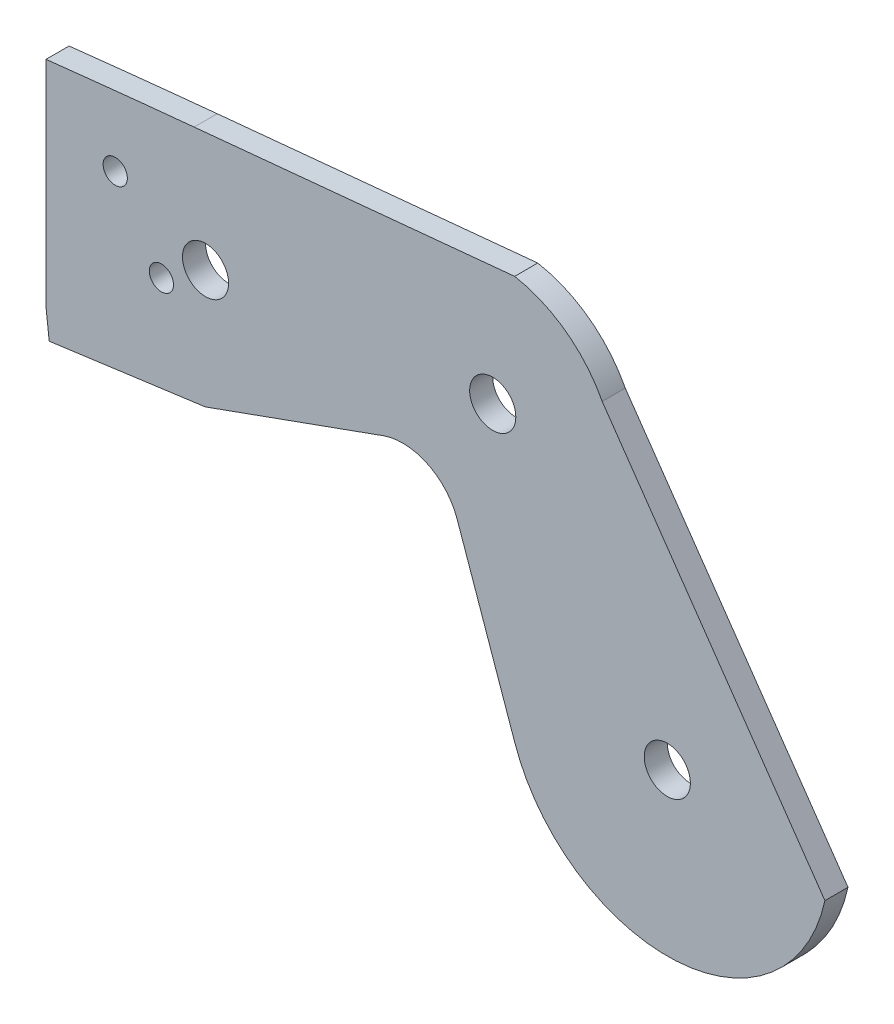
ISO-10303-21;
HEADER;
FILE_DESCRIPTION(('STEP AP214'),'2;1');
FILE_NAME('part.step','',(''),(''),'','','');
FILE_SCHEMA(('AUTOMOTIVE_DESIGN { 1 0 10303 214 1 1 1 1 }'));
ENDSEC;
DATA;
#1=APPLICATION_CONTEXT('core data for automotive mechanical design processes');
#2=APPLICATION_PROTOCOL_DEFINITION('international standard','automotive_design',2000,#1);
#3=PRODUCT_CONTEXT('',#1,'mechanical');
#4=PRODUCT('Part','Part','',(#3));
#5=PRODUCT_RELATED_PRODUCT_CATEGORY('part','',(#4));
#6=PRODUCT_DEFINITION_FORMATION('','',#4);
#7=PRODUCT_DEFINITION_CONTEXT('part definition',#1,'design');
#8=PRODUCT_DEFINITION('design','',#6,#7);
#9=PRODUCT_DEFINITION_SHAPE('','',#8);
#10=(LENGTH_UNIT() NAMED_UNIT(*) SI_UNIT(.MILLI.,.METRE.));
#11=(NAMED_UNIT(*) PLANE_ANGLE_UNIT() SI_UNIT($,.RADIAN.));
#12=(NAMED_UNIT(*) SI_UNIT($,.STERADIAN.) SOLID_ANGLE_UNIT());
#13=UNCERTAINTY_MEASURE_WITH_UNIT(LENGTH_MEASURE(1.E-05),#10,'distance_accuracy_value','');
#14=(GEOMETRIC_REPRESENTATION_CONTEXT(3) GLOBAL_UNCERTAINTY_ASSIGNED_CONTEXT((#13)) GLOBAL_UNIT_ASSIGNED_CONTEXT((#10,
#11,#12)) REPRESENTATION_CONTEXT('',''));
#15=CARTESIAN_POINT('',(0.,0.,0.));
#16=DIRECTION('',(0.,0.,1.));
#17=DIRECTION('',(1.,0.,0.));
#18=AXIS2_PLACEMENT_3D('',#15,#16,#17);
#19=CARTESIAN_POINT('',(78.8817099723591,27.6055271060531,4.));
#20=DIRECTION('',(0.943869814927785,0.330317684159035,0.));
#21=DIRECTION('',(-0.330317684159035,0.943869814927785,0.));
#22=AXIS2_PLACEMENT_3D('',#19,#20,#21);
#23=PLANE('',#22);
#24=DIRECTION('',(0.330317684159035,-0.943869814927785,0.));
#25=VECTOR('',#24,1.);
#26=CARTESIAN_POINT('',(78.8817099723591,27.6055271060531,0.));
#27=LINE('',#26,#25);
#28=CARTESIAN_POINT('',(71.2477694864193,49.4192123526611,0.));
#29=VERTEX_POINT('',#28);
#30=CARTESIAN_POINT('',(81.1757562039249,21.0503800586389,0.));
#31=VERTEX_POINT('',#30);
#32=EDGE_CURVE('E182',#29,#31,#27,.T.);
#33=ORIENTED_EDGE('',*,*,#32,.T.);
#34=DIRECTION('',(0.,0.,-1.));
#35=VECTOR('',#34,1.);
#36=CARTESIAN_POINT('',(81.1757562039249,21.0503800586389,4.));
#37=LINE('',#36,#35);
#38=CARTESIAN_POINT('',(81.1757562039249,21.0503800586389,4.));
#39=VERTEX_POINT('',#38);
#40=EDGE_CURVE('E11',#39,#31,#37,.T.);
#41=ORIENTED_EDGE('',*,*,#40,.F.);
#42=DIRECTION('',(0.330317684159035,-0.943869814927785,0.));
#43=VECTOR('',#42,1.);
#44=CARTESIAN_POINT('',(78.8817099723591,27.6055271060531,4.));
#45=LINE('',#44,#43);
#46=CARTESIAN_POINT('',(71.2477694864193,49.4192123526611,4.));
#47=VERTEX_POINT('',#46);
#48=EDGE_CURVE('E268',#47,#39,#45,.T.);
#49=ORIENTED_EDGE('',*,*,#48,.F.);
#50=DIRECTION('',(0.,0.,-1.));
#51=VECTOR('',#50,1.);
#52=CARTESIAN_POINT('',(71.2477694864193,49.4192123526611,4.));
#53=LINE('',#52,#51);
#54=EDGE_CURVE('E158',#47,#29,#53,.T.);
#55=ORIENTED_EDGE('',*,*,#54,.T.);
#56=EDGE_LOOP('',(#33,#41,#49,#55));
#57=FACE_BOUND('',#56,.T.);
#58=ADVANCED_FACE('F41',(#57),#23,.F.);
#59=CARTESIAN_POINT('',(107.662812973354,30.,4.));
#60=DIRECTION('',(0.,0.,-1.));
#61=DIRECTION('',(-1.,0.,0.));
#62=AXIS2_PLACEMENT_3D('',#59,#60,#61);
#63=CYLINDRICAL_SURFACE('',#62,27.9581807956413);
#64=CARTESIAN_POINT('',(107.662812973354,30.,0.));
#65=DIRECTION('',(0.,0.,1.));
#66=DIRECTION('',(1.,0.,0.));
#67=AXIS2_PLACEMENT_3D('',#64,#65,#66);
#68=CIRCLE('',#67,27.9581807956413);
#69=CARTESIAN_POINT('',(134.977054883392,24.0340916633161,0.));
#70=VERTEX_POINT('',#69);
#71=EDGE_CURVE('E186',#31,#70,#68,.T.);
#72=ORIENTED_EDGE('',*,*,#71,.T.);
#73=DIRECTION('',(0.,0.,-1.));
#74=VECTOR('',#73,1.);
#75=CARTESIAN_POINT('',(134.977054883392,24.0340916633161,4.));
#76=LINE('',#75,#74);
#77=CARTESIAN_POINT('',(134.977054883392,24.0340916633161,4.));
#78=VERTEX_POINT('',#77);
#79=EDGE_CURVE('E51',#78,#70,#76,.T.);
#80=ORIENTED_EDGE('',*,*,#79,.F.);
#81=CARTESIAN_POINT('',(107.662812973354,30.,4.));
#82=DIRECTION('',(0.,0.,1.));
#83=DIRECTION('',(1.,0.,0.));
#84=AXIS2_PLACEMENT_3D('',#81,#82,#83);
#85=CIRCLE('',#84,27.9581807956413);
#86=EDGE_CURVE('E111',#39,#78,#85,.T.);
#87=ORIENTED_EDGE('',*,*,#86,.F.);
#88=ORIENTED_EDGE('',*,*,#40,.T.);
#89=EDGE_LOOP('',(#72,#80,#87,#88));
#90=FACE_BOUND('',#89,.T.);
#91=ADVANCED_FACE('F247',(#90),#63,.T.);
#92=CARTESIAN_POINT('',(102.357579070315,71.036194972334,4.));
#93=DIRECTION('',(0.821540862063693,0.570149639971511,0.));
#94=DIRECTION('',(-0.570149639971511,0.821540862063693,0.));
#95=AXIS2_PLACEMENT_3D('',#92,#93,#94);
#96=PLANE('',#95);
#97=DIRECTION('',(0.570149639971511,-0.821540862063693,0.));
#98=VECTOR('',#97,1.);
#99=CARTESIAN_POINT('',(102.357579070315,71.036194972334,0.));
#100=LINE('',#99,#98);
#101=CARTESIAN_POINT('',(96.3802559625134,79.6490482209344,0.));
#102=VERTEX_POINT('',#101);
#103=EDGE_CURVE('E190',#102,#70,#100,.T.);
#104=ORIENTED_EDGE('',*,*,#103,.F.);
#105=DIRECTION('',(0.,0.,-1.));
#106=VECTOR('',#105,1.);
#107=CARTESIAN_POINT('',(96.3802559625134,79.6490482209344,4.));
#108=LINE('',#107,#106);
#109=CARTESIAN_POINT('',(96.3802559625134,79.6490482209344,4.));
#110=VERTEX_POINT('',#109);
#111=EDGE_CURVE('E238',#110,#102,#108,.T.);
#112=ORIENTED_EDGE('',*,*,#111,.F.);
#113=DIRECTION('',(0.570149639971511,-0.821540862063693,0.));
#114=VECTOR('',#113,1.);
#115=CARTESIAN_POINT('',(102.357579070315,71.036194972334,4.));
#116=LINE('',#115,#114);
#117=EDGE_CURVE('E246',#110,#78,#116,.T.);
#118=ORIENTED_EDGE('',*,*,#117,.T.);
#119=ORIENTED_EDGE('',*,*,#79,.T.);
#120=EDGE_LOOP('',(#104,#112,#118,#119));
#121=FACE_BOUND('',#120,.T.);
#122=ADVANCED_FACE('F244',(#121),#96,.T.);
#123=CARTESIAN_POINT('',(77.4123392683536,69.8109135868933,4.));
#124=DIRECTION('',(0.,0.,-1.));
#125=DIRECTION('',(-1.,0.,0.));
#126=AXIS2_PLACEMENT_3D('',#123,#124,#125);
#127=CYLINDRICAL_SURFACE('',#126,21.3675163927421);
#128=CARTESIAN_POINT('',(77.4123392683536,69.8109135868933,0.));
#129=DIRECTION('',(0.,0.,1.));
#130=DIRECTION('',(1.,0.,0.));
#131=AXIS2_PLACEMENT_3D('',#128,#129,#130);
#132=CIRCLE('',#131,21.3675163927421);
#133=CARTESIAN_POINT('',(81.2137044633508,90.8375723668414,0.));
#134=VERTEX_POINT('',#133);
#135=EDGE_CURVE('E194',#102,#134,#132,.T.);
#136=ORIENTED_EDGE('',*,*,#135,.T.);
#137=DIRECTION('',(0.,0.,-1.));
#138=VECTOR('',#137,1.);
#139=CARTESIAN_POINT('',(81.2137044633508,90.8375723668414,4.));
#140=LINE('',#139,#138);
#141=CARTESIAN_POINT('',(81.2137044633508,90.8375723668414,4.));
#142=VERTEX_POINT('',#141);
#143=EDGE_CURVE('E235',#142,#134,#140,.T.);
#144=ORIENTED_EDGE('',*,*,#143,.F.);
#145=CARTESIAN_POINT('',(77.4123392683536,69.8109135868933,4.));
#146=DIRECTION('',(0.,0.,1.));
#147=DIRECTION('',(1.,0.,0.));
#148=AXIS2_PLACEMENT_3D('',#145,#146,#147);
#149=CIRCLE('',#148,21.3675163927421);
#150=EDGE_CURVE('E260',#110,#142,#149,.T.);
#151=ORIENTED_EDGE('',*,*,#150,.F.);
#152=ORIENTED_EDGE('',*,*,#111,.T.);
#153=EDGE_LOOP('',(#136,#144,#151,#152));
#154=FACE_BOUND('',#153,.T.);
#155=ADVANCED_FACE('F257',(#154),#127,.T.);
#156=CARTESIAN_POINT('',(-7.94780890689138,82.2186159148116,4.));
#157=DIRECTION('',(-0.0962182717378652,0.995360258491255,0.));
#158=DIRECTION('',(-0.995360258491255,-0.0962182717378652,0.));
#159=AXIS2_PLACEMENT_3D('',#156,#157,#158);
#160=PLANE('',#159);
#161=DIRECTION('',(0.995360258491255,0.0962182717378652,0.));
#162=VECTOR('',#161,1.);
#163=CARTESIAN_POINT('',(-7.94780890689138,82.2186159148116,0.));
#164=LINE('',#163,#162);
#165=CARTESIAN_POINT('',(25.6657573338973,85.4679311482099,0.));
#166=VERTEX_POINT('',#165);
#167=EDGE_CURVE('E198',#166,#134,#164,.T.);
#168=ORIENTED_EDGE('',*,*,#167,.F.);
#169=DIRECTION('',(0.,0.,-1.));
#170=VECTOR('',#169,1.);
#171=CARTESIAN_POINT('',(25.6657573338973,85.4679311482099,4.));
#172=LINE('',#171,#170);
#173=CARTESIAN_POINT('',(25.6657573338973,85.4679311482099,4.));
#174=VERTEX_POINT('',#173);
#175=EDGE_CURVE('E232',#174,#166,#172,.T.);
#176=ORIENTED_EDGE('',*,*,#175,.F.);
#177=DIRECTION('',(0.995360258491255,0.0962182717378652,0.));
#178=VECTOR('',#177,1.);
#179=CARTESIAN_POINT('',(-7.94780890689138,82.2186159148116,4.));
#180=LINE('',#179,#178);
#181=EDGE_CURVE('E263',#174,#142,#180,.T.);
#182=ORIENTED_EDGE('',*,*,#181,.T.);
#183=ORIENTED_EDGE('',*,*,#143,.T.);
#184=EDGE_LOOP('',(#168,#176,#182,#183));
#185=FACE_BOUND('',#184,.T.);
#186=ADVANCED_FACE('F437',(#185),#160,.T.);
#187=CARTESIAN_POINT('',(197.220867112833,-1689.23800911509,4.));
#188=DIRECTION('',(0.,0.,-1.));
#189=DIRECTION('',(-1.,0.,0.));
#190=AXIS2_PLACEMENT_3D('',#187,#188,#189);
#191=CYLINDRICAL_SURFACE('',#190,1782.97849961717);
#192=CARTESIAN_POINT('',(197.220867112833,-1689.23800911509,0.));
#193=DIRECTION('',(0.,0.,1.));
#194=DIRECTION('',(1.,0.,0.));
#195=AXIS2_PLACEMENT_3D('',#192,#193,#194);
#196=CIRCLE('',#195,1782.97849961717);
#197=CARTESIAN_POINT('',(0.,82.7993098125808,0.));
#198=VERTEX_POINT('',#197);
#199=EDGE_CURVE('E202',#166,#198,#196,.T.);
#200=ORIENTED_EDGE('',*,*,#199,.T.);
#201=DIRECTION('',(0.,0.,-1.));
#202=VECTOR('',#201,1.);
#203=CARTESIAN_POINT('',(0.,82.7993098125808,4.));
#204=LINE('',#203,#202);
#205=CARTESIAN_POINT('',(0.,82.7993098125808,4.));
#206=VERTEX_POINT('',#205);
#207=EDGE_CURVE('E229',#206,#198,#204,.T.);
#208=ORIENTED_EDGE('',*,*,#207,.F.);
#209=CARTESIAN_POINT('',(197.220867112833,-1689.23800911509,4.));
#210=DIRECTION('',(0.,0.,1.));
#211=DIRECTION('',(1.,0.,0.));
#212=AXIS2_PLACEMENT_3D('',#209,#210,#211);
#213=CIRCLE('',#212,1782.97849961717);
#214=EDGE_CURVE('E274',#174,#206,#213,.T.);
#215=ORIENTED_EDGE('',*,*,#214,.F.);
#216=ORIENTED_EDGE('',*,*,#175,.T.);
#217=EDGE_LOOP('',(#200,#208,#215,#216));
#218=FACE_BOUND('',#217,.T.);
#219=ADVANCED_FACE('F287',(#218),#191,.T.);
#220=CARTESIAN_POINT('',(0.,0.,4.));
#221=DIRECTION('',(-1.,0.,0.));
#222=DIRECTION('',(0.,0.,1.));
#223=AXIS2_PLACEMENT_3D('',#220,#221,#222);
#224=PLANE('',#223);
#225=DIRECTION('',(0.,1.,0.));
#226=VECTOR('',#225,1.);
#227=CARTESIAN_POINT('',(0.,0.,0.));
#228=LINE('',#227,#226);
#229=CARTESIAN_POINT('',(0.,45.6506733001944,0.));
#230=VERTEX_POINT('',#229);
#231=EDGE_CURVE('E206',#230,#198,#228,.T.);
#232=ORIENTED_EDGE('',*,*,#231,.F.);
#233=DIRECTION('',(0.,0.,-1.));
#234=VECTOR('',#233,1.);
#235=CARTESIAN_POINT('',(0.,45.6506733001944,4.));
#236=LINE('',#235,#234);
#237=CARTESIAN_POINT('',(0.,45.6506733001944,4.));
#238=VERTEX_POINT('',#237);
#239=EDGE_CURVE('E226',#238,#230,#236,.T.);
#240=ORIENTED_EDGE('',*,*,#239,.F.);
#241=DIRECTION('',(0.,1.,0.));
#242=VECTOR('',#241,1.);
#243=CARTESIAN_POINT('',(0.,0.,4.));
#244=LINE('',#243,#242);
#245=EDGE_CURVE('E277',#238,#206,#244,.T.);
#246=ORIENTED_EDGE('',*,*,#245,.T.);
#247=ORIENTED_EDGE('',*,*,#207,.T.);
#248=EDGE_LOOP('',(#232,#240,#246,#247));
#249=FACE_BOUND('',#248,.T.);
#250=ADVANCED_FACE('F283',(#249),#224,.T.);
#251=CARTESIAN_POINT('',(5.12332628744823,0.582415957377632,4.));
#252=DIRECTION('',(0.993600471899069,0.112951769538807,0.));
#253=DIRECTION('',(-0.112951769538807,0.993600471899069,0.));
#254=AXIS2_PLACEMENT_3D('',#251,#252,#253);
#255=PLANE('',#254);
#256=DIRECTION('',(0.112951769538807,-0.993600471899069,0.));
#257=VECTOR('',#256,1.);
#258=CARTESIAN_POINT('',(5.12332628744823,0.582415957377632,0.));
#259=LINE('',#258,#257);
#260=CARTESIAN_POINT('',(0.554484915209473,40.7730474279962,0.));
#261=VERTEX_POINT('',#260);
#262=EDGE_CURVE('E210',#230,#261,#259,.T.);
#263=ORIENTED_EDGE('',*,*,#262,.T.);
#264=DIRECTION('',(0.,0.,-1.));
#265=VECTOR('',#264,1.);
#266=CARTESIAN_POINT('',(0.554484915209473,40.7730474279962,4.));
#267=LINE('',#266,#265);
#268=CARTESIAN_POINT('',(0.554484915209473,40.7730474279962,4.));
#269=VERTEX_POINT('',#268);
#270=EDGE_CURVE('E151',#269,#261,#267,.T.);
#271=ORIENTED_EDGE('',*,*,#270,.F.);
#272=DIRECTION('',(0.112951769538807,-0.993600471899069,0.));
#273=VECTOR('',#272,1.);
#274=CARTESIAN_POINT('',(5.12332628744823,0.582415957377632,4.));
#275=LINE('',#274,#273);
#276=EDGE_CURVE('E140',#238,#269,#275,.T.);
#277=ORIENTED_EDGE('',*,*,#276,.F.);
#278=ORIENTED_EDGE('',*,*,#239,.T.);
#279=EDGE_LOOP('',(#263,#271,#277,#278));
#280=FACE_BOUND('',#279,.T.);
#281=ADVANCED_FACE('F290',(#280),#255,.F.);
#282=CARTESIAN_POINT('',(-5.41460505653085,39.9643194121234,4.));
#283=DIRECTION('',(-0.134259323213009,0.990946231705023,0.));
#284=DIRECTION('',(-0.990946231705023,-0.134259323213009,0.));
#285=AXIS2_PLACEMENT_3D('',#282,#283,#284);
#286=PLANE('',#285);
#287=DIRECTION('',(0.990946231705023,0.134259323213009,0.));
#288=VECTOR('',#287,1.);
#289=CARTESIAN_POINT('',(-5.41460505653085,39.9643194121234,0.));
#290=LINE('',#289,#288);
#291=CARTESIAN_POINT('',(27.595444365701,44.4367183706737,0.));
#292=VERTEX_POINT('',#291);
#293=EDGE_CURVE('E149',#261,#292,#290,.T.);
#294=ORIENTED_EDGE('',*,*,#293,.T.);
#295=DIRECTION('',(0.,0.,-1.));
#296=VECTOR('',#295,1.);
#297=CARTESIAN_POINT('',(27.595444365701,44.4367183706737,4.));
#298=LINE('',#297,#296);
#299=CARTESIAN_POINT('',(27.595444365701,44.4367183706737,4.));
#300=VERTEX_POINT('',#299);
#301=EDGE_CURVE('E146',#300,#292,#298,.T.);
#302=ORIENTED_EDGE('',*,*,#301,.F.);
#303=DIRECTION('',(0.990946231705023,0.134259323213009,0.));
#304=VECTOR('',#303,1.);
#305=CARTESIAN_POINT('',(-5.41460505653085,39.9643194121234,4.));
#306=LINE('',#305,#304);
#307=EDGE_CURVE('E133',#269,#300,#306,.T.);
#308=ORIENTED_EDGE('',*,*,#307,.F.);
#309=ORIENTED_EDGE('',*,*,#270,.T.);
#310=EDGE_LOOP('',(#294,#302,#308,#309));
#311=FACE_BOUND('',#310,.T.);
#312=ADVANCED_FACE('F147',(#311),#286,.F.);
#313=CARTESIAN_POINT('',(-10.9913315622301,30.5571502696171,4.));
#314=DIRECTION('',(-0.338467495274097,0.940978084039623,0.));
#315=DIRECTION('',(-0.940978084039623,-0.338467495274097,0.));
#316=AXIS2_PLACEMENT_3D('',#313,#314,#315);
#317=PLANE('',#316);
#318=DIRECTION('',(0.940978084039623,0.338467495274097,0.));
#319=VECTOR('',#318,1.);
#320=CARTESIAN_POINT('',(-10.9913315622301,30.5571502696171,0.));
#321=LINE('',#320,#319);
#322=CARTESIAN_POINT('',(58.4243963844005,55.525816351467,0.));
#323=VERTEX_POINT('',#322);
#324=EDGE_CURVE('E97',#292,#323,#321,.T.);
#325=ORIENTED_EDGE('',*,*,#324,.T.);
#326=DIRECTION('',(0.,0.,-1.));
#327=VECTOR('',#326,1.);
#328=CARTESIAN_POINT('',(58.4243963844005,55.525816351467,4.));
#329=LINE('',#328,#327);
#330=CARTESIAN_POINT('',(58.4243963844005,55.525816351467,4.));
#331=VERTEX_POINT('',#330);
#332=EDGE_CURVE('E152',#331,#323,#329,.T.);
#333=ORIENTED_EDGE('',*,*,#332,.F.);
#334=DIRECTION('',(0.940978084039623,0.338467495274097,0.));
#335=VECTOR('',#334,1.);
#336=CARTESIAN_POINT('',(-10.9913315622301,30.5571502696171,4.));
#337=LINE('',#336,#335);
#338=EDGE_CURVE('E137',#300,#331,#337,.T.);
#339=ORIENTED_EDGE('',*,*,#338,.F.);
#340=ORIENTED_EDGE('',*,*,#301,.T.);
#341=EDGE_LOOP('',(#325,#333,#339,#340));
#342=FACE_BOUND('',#341,.T.);
#343=ADVANCED_FACE('F154',(#342),#317,.F.);
#344=CARTESIAN_POINT('',(20.,60.,4.));
#345=DIRECTION('',(0.,0.,-1.));
#346=DIRECTION('',(-1.,0.,0.));
#347=AXIS2_PLACEMENT_3D('',#344,#345,#346);
#348=CYLINDRICAL_SURFACE('',#347,2.1);
#349=CARTESIAN_POINT('',(20.,60.,4.));
#350=DIRECTION('',(0.,0.,1.));
#351=DIRECTION('',(1.,0.,0.));
#352=AXIS2_PLACEMENT_3D('',#349,#350,#351);
#353=CIRCLE('',#352,2.1);
#354=CARTESIAN_POINT('',(22.1,60.,4.));
#355=VERTEX_POINT('',#354);
#356=EDGE_CURVE('E491',#355,#355,#353,.T.);
#357=ORIENTED_EDGE('',*,*,#356,.T.);
#358=EDGE_LOOP('',(#357));
#359=FACE_BOUND('',#358,.T.);
#360=CARTESIAN_POINT('',(20.,60.,0.));
#361=DIRECTION('',(0.,0.,1.));
#362=DIRECTION('',(1.,0.,0.));
#363=AXIS2_PLACEMENT_3D('',#360,#361,#362);
#364=CIRCLE('',#363,2.1);
#365=CARTESIAN_POINT('',(22.1,60.,0.));
#366=VERTEX_POINT('',#365);
#367=EDGE_CURVE('E178',#366,#366,#364,.T.);
#368=ORIENTED_EDGE('',*,*,#367,.F.);
#369=EDGE_LOOP('',(#368));
#370=FACE_BOUND('',#369,.T.);
#371=ADVANCED_FACE('F308',(#359,#370),#348,.F.);
#372=CARTESIAN_POINT('',(12.,72.,4.));
#373=DIRECTION('',(0.,0.,-1.));
#374=DIRECTION('',(-1.,0.,0.));
#375=AXIS2_PLACEMENT_3D('',#372,#373,#374);
#376=CYLINDRICAL_SURFACE('',#375,2.1);
#377=CARTESIAN_POINT('',(12.,72.,4.));
#378=DIRECTION('',(0.,0.,1.));
#379=DIRECTION('',(1.,0.,0.));
#380=AXIS2_PLACEMENT_3D('',#377,#378,#379);
#381=CIRCLE('',#380,2.1);
#382=CARTESIAN_POINT('',(14.1,72.,4.));
#383=VERTEX_POINT('',#382);
#384=EDGE_CURVE('E488',#383,#383,#381,.T.);
#385=ORIENTED_EDGE('',*,*,#384,.T.);
#386=EDGE_LOOP('',(#385));
#387=FACE_BOUND('',#386,.T.);
#388=CARTESIAN_POINT('',(12.,72.,0.));
#389=DIRECTION('',(0.,0.,1.));
#390=DIRECTION('',(1.,0.,0.));
#391=AXIS2_PLACEMENT_3D('',#388,#389,#390);
#392=CIRCLE('',#391,2.1);
#393=CARTESIAN_POINT('',(14.1,72.,0.));
#394=VERTEX_POINT('',#393);
#395=EDGE_CURVE('E174',#394,#394,#392,.T.);
#396=ORIENTED_EDGE('',*,*,#395,.F.);
#397=EDGE_LOOP('',(#396));
#398=FACE_BOUND('',#397,.T.);
#399=ADVANCED_FACE('F311',(#387,#398),#376,.F.);
#400=CARTESIAN_POINT('',(107.662812973354,30.,4.));
#401=DIRECTION('',(0.,0.,-1.));
#402=DIRECTION('',(-1.,0.,0.));
#403=AXIS2_PLACEMENT_3D('',#400,#401,#402);
#404=CYLINDRICAL_SURFACE('',#403,3.99999999999999);
#405=CARTESIAN_POINT('',(107.662812973354,30.,4.));
#406=DIRECTION('',(0.,0.,1.));
#407=DIRECTION('',(1.,0.,0.));
#408=AXIS2_PLACEMENT_3D('',#405,#406,#407);
#409=CIRCLE('',#408,3.99999999999999);
#410=CARTESIAN_POINT('',(111.662812973354,30.,4.));
#411=VERTEX_POINT('',#410);
#412=EDGE_CURVE('E484',#411,#411,#409,.T.);
#413=ORIENTED_EDGE('',*,*,#412,.T.);
#414=EDGE_LOOP('',(#413));
#415=FACE_BOUND('',#414,.T.);
#416=CARTESIAN_POINT('',(107.662812973354,30.,0.));
#417=DIRECTION('',(0.,0.,1.));
#418=DIRECTION('',(1.,0.,0.));
#419=AXIS2_PLACEMENT_3D('',#416,#417,#418);
#420=CIRCLE('',#419,3.99999999999999);
#421=CARTESIAN_POINT('',(111.662812973354,30.,0.));
#422=VERTEX_POINT('',#421);
#423=EDGE_CURVE('E170',#422,#422,#420,.T.);
#424=ORIENTED_EDGE('',*,*,#423,.F.);
#425=EDGE_LOOP('',(#424));
#426=FACE_BOUND('',#425,.T.);
#427=ADVANCED_FACE('F315',(#415,#426),#404,.F.);
#428=CARTESIAN_POINT('',(77.4123392683536,69.8109135868933,4.));
#429=DIRECTION('',(0.,0.,-1.));
#430=DIRECTION('',(-1.,0.,0.));
#431=AXIS2_PLACEMENT_3D('',#428,#429,#430);
#432=CYLINDRICAL_SURFACE('',#431,4.00000000000001);
#433=CARTESIAN_POINT('',(77.4123392683536,69.8109135868933,4.));
#434=DIRECTION('',(0.,0.,1.));
#435=DIRECTION('',(1.,0.,0.));
#436=AXIS2_PLACEMENT_3D('',#433,#434,#435);
#437=CIRCLE('',#436,4.00000000000001);
#438=CARTESIAN_POINT('',(81.4123392683536,69.8109135868933,4.));
#439=VERTEX_POINT('',#438);
#440=EDGE_CURVE('E330',#439,#439,#437,.T.);
#441=ORIENTED_EDGE('',*,*,#440,.T.);
#442=EDGE_LOOP('',(#441));
#443=FACE_BOUND('',#442,.T.);
#444=CARTESIAN_POINT('',(77.4123392683536,69.8109135868933,0.));
#445=DIRECTION('',(0.,0.,1.));
#446=DIRECTION('',(1.,0.,0.));
#447=AXIS2_PLACEMENT_3D('',#444,#445,#446);
#448=CIRCLE('',#447,4.00000000000001);
#449=CARTESIAN_POINT('',(81.4123392683536,69.8109135868933,0.));
#450=VERTEX_POINT('',#449);
#451=EDGE_CURVE('E166',#450,#450,#448,.T.);
#452=ORIENTED_EDGE('',*,*,#451,.F.);
#453=EDGE_LOOP('',(#452));
#454=FACE_BOUND('',#453,.T.);
#455=ADVANCED_FACE('F318',(#443,#454),#432,.F.);
#456=CARTESIAN_POINT('',(27.6443263437908,65.,4.));
#457=DIRECTION('',(0.,0.,-1.));
#458=DIRECTION('',(-1.,0.,0.));
#459=AXIS2_PLACEMENT_3D('',#456,#457,#458);
#460=CYLINDRICAL_SURFACE('',#459,4.00000000000001);
#461=CARTESIAN_POINT('',(27.6443263437908,65.,4.));
#462=DIRECTION('',(0.,0.,1.));
#463=DIRECTION('',(1.,0.,0.));
#464=AXIS2_PLACEMENT_3D('',#461,#462,#463);
#465=CIRCLE('',#464,4.00000000000001);
#466=CARTESIAN_POINT('',(31.6443263437909,65.,4.));
#467=VERTEX_POINT('',#466);
#468=EDGE_CURVE('E219',#467,#467,#465,.T.);
#469=ORIENTED_EDGE('',*,*,#468,.T.);
#470=EDGE_LOOP('',(#469));
#471=FACE_BOUND('',#470,.T.);
#472=CARTESIAN_POINT('',(27.6443263437908,65.,0.));
#473=DIRECTION('',(0.,0.,1.));
#474=DIRECTION('',(1.,0.,0.));
#475=AXIS2_PLACEMENT_3D('',#472,#473,#474);
#476=CIRCLE('',#475,4.00000000000001);
#477=CARTESIAN_POINT('',(31.6443263437909,65.,0.));
#478=VERTEX_POINT('',#477);
#479=EDGE_CURVE('E162',#478,#478,#476,.T.);
#480=ORIENTED_EDGE('',*,*,#479,.F.);
#481=EDGE_LOOP('',(#480));
#482=FACE_BOUND('',#481,.T.);
#483=ADVANCED_FACE('F43',(#471,#482),#460,.F.);
#484=CARTESIAN_POINT('',(61.8090713371415,46.1160355110707,4.));
#485=DIRECTION('',(0.,0.,-1.));
#486=DIRECTION('',(-1.,0.,0.));
#487=AXIS2_PLACEMENT_3D('',#484,#485,#486);
#488=CYLINDRICAL_SURFACE('',#487,10.);
#489=CARTESIAN_POINT('',(61.8090713371415,46.1160355110707,0.));
#490=DIRECTION('',(0.,0.,1.));
#491=DIRECTION('',(1.,0.,0.));
#492=AXIS2_PLACEMENT_3D('',#489,#490,#491);
#493=CIRCLE('',#492,10.);
#494=EDGE_CURVE('E103',#323,#29,#493,.F.);
#495=ORIENTED_EDGE('',*,*,#494,.T.);
#496=ORIENTED_EDGE('',*,*,#54,.F.);
#497=CARTESIAN_POINT('',(61.8090713371415,46.1160355110707,4.));
#498=DIRECTION('',(0.,0.,1.));
#499=DIRECTION('',(1.,0.,0.));
#500=AXIS2_PLACEMENT_3D('',#497,#498,#499);
#501=CIRCLE('',#500,10.);
#502=EDGE_CURVE('E59',#331,#47,#501,.F.);
#503=ORIENTED_EDGE('',*,*,#502,.F.);
#504=ORIENTED_EDGE('',*,*,#332,.T.);
#505=EDGE_LOOP('',(#495,#496,#503,#504));
#506=FACE_BOUND('',#505,.T.);
#507=ADVANCED_FACE('F325',(#506),#488,.F.);
#508=CARTESIAN_POINT('',(0.,0.,4.));
#509=DIRECTION('',(0.,0.,1.));
#510=DIRECTION('',(1.,0.,0.));
#511=AXIS2_PLACEMENT_3D('',#508,#509,#510);
#512=PLANE('',#511);
#513=ORIENTED_EDGE('',*,*,#468,.F.);
#514=EDGE_LOOP('',(#513));
#515=FACE_BOUND('',#514,.T.);
#516=ORIENTED_EDGE('',*,*,#440,.F.);
#517=EDGE_LOOP('',(#516));
#518=FACE_BOUND('',#517,.T.);
#519=ORIENTED_EDGE('',*,*,#412,.F.);
#520=EDGE_LOOP('',(#519));
#521=FACE_BOUND('',#520,.T.);
#522=ORIENTED_EDGE('',*,*,#384,.F.);
#523=EDGE_LOOP('',(#522));
#524=FACE_BOUND('',#523,.T.);
#525=ORIENTED_EDGE('',*,*,#356,.F.);
#526=EDGE_LOOP('',(#525));
#527=FACE_BOUND('',#526,.T.);
#528=ORIENTED_EDGE('',*,*,#48,.T.);
#529=ORIENTED_EDGE('',*,*,#86,.T.);
#530=ORIENTED_EDGE('',*,*,#117,.F.);
#531=ORIENTED_EDGE('',*,*,#150,.T.);
#532=ORIENTED_EDGE('',*,*,#181,.F.);
#533=ORIENTED_EDGE('',*,*,#214,.T.);
#534=ORIENTED_EDGE('',*,*,#245,.F.);
#535=ORIENTED_EDGE('',*,*,#276,.T.);
#536=ORIENTED_EDGE('',*,*,#307,.T.);
#537=ORIENTED_EDGE('',*,*,#338,.T.);
#538=ORIENTED_EDGE('',*,*,#502,.T.);
#539=EDGE_LOOP('',(#528,#529,#530,#531,#532,#533,#534,#535,#536,#537,#538));
#540=FACE_BOUND('',#539,.T.);
#541=ADVANCED_FACE('F135',(#515,#518,#521,#524,#527,#540),#512,.T.);
#542=CARTESIAN_POINT('',(0.,0.,0.));
#543=DIRECTION('',(0.,0.,1.));
#544=DIRECTION('',(1.,0.,0.));
#545=AXIS2_PLACEMENT_3D('',#542,#543,#544);
#546=PLANE('',#545);
#547=ORIENTED_EDGE('',*,*,#479,.T.);
#548=EDGE_LOOP('',(#547));
#549=FACE_BOUND('',#548,.T.);
#550=ORIENTED_EDGE('',*,*,#451,.T.);
#551=EDGE_LOOP('',(#550));
#552=FACE_BOUND('',#551,.T.);
#553=ORIENTED_EDGE('',*,*,#423,.T.);
#554=EDGE_LOOP('',(#553));
#555=FACE_BOUND('',#554,.T.);
#556=ORIENTED_EDGE('',*,*,#395,.T.);
#557=EDGE_LOOP('',(#556));
#558=FACE_BOUND('',#557,.T.);
#559=ORIENTED_EDGE('',*,*,#367,.T.);
#560=EDGE_LOOP('',(#559));
#561=FACE_BOUND('',#560,.T.);
#562=ORIENTED_EDGE('',*,*,#32,.F.);
#563=ORIENTED_EDGE('',*,*,#494,.F.);
#564=ORIENTED_EDGE('',*,*,#324,.F.);
#565=ORIENTED_EDGE('',*,*,#293,.F.);
#566=ORIENTED_EDGE('',*,*,#262,.F.);
#567=ORIENTED_EDGE('',*,*,#231,.T.);
#568=ORIENTED_EDGE('',*,*,#199,.F.);
#569=ORIENTED_EDGE('',*,*,#167,.T.);
#570=ORIENTED_EDGE('',*,*,#135,.F.);
#571=ORIENTED_EDGE('',*,*,#103,.T.);
#572=ORIENTED_EDGE('',*,*,#71,.F.);
#573=EDGE_LOOP('',(#562,#563,#564,#565,#566,#567,#568,#569,#570,#571,#572));
#574=FACE_BOUND('',#573,.T.);
#575=ADVANCED_FACE('F252',(#549,#552,#555,#558,#561,#574),#546,.F.);
#576=CLOSED_SHELL('',(#58,#91,#122,#155,#186,#219,#250,#281,#312,#343,#371,#399,#427,#455,#483,
#507,#541,#575));
#577=MANIFOLD_SOLID_BREP('B2',#576);
#578=ADVANCED_BREP_SHAPE_REPRESENTATION('',(#18,#577),#14);
#579=SHAPE_DEFINITION_REPRESENTATION(#9,#578);
ENDSEC;
END-ISO-10303-21;
